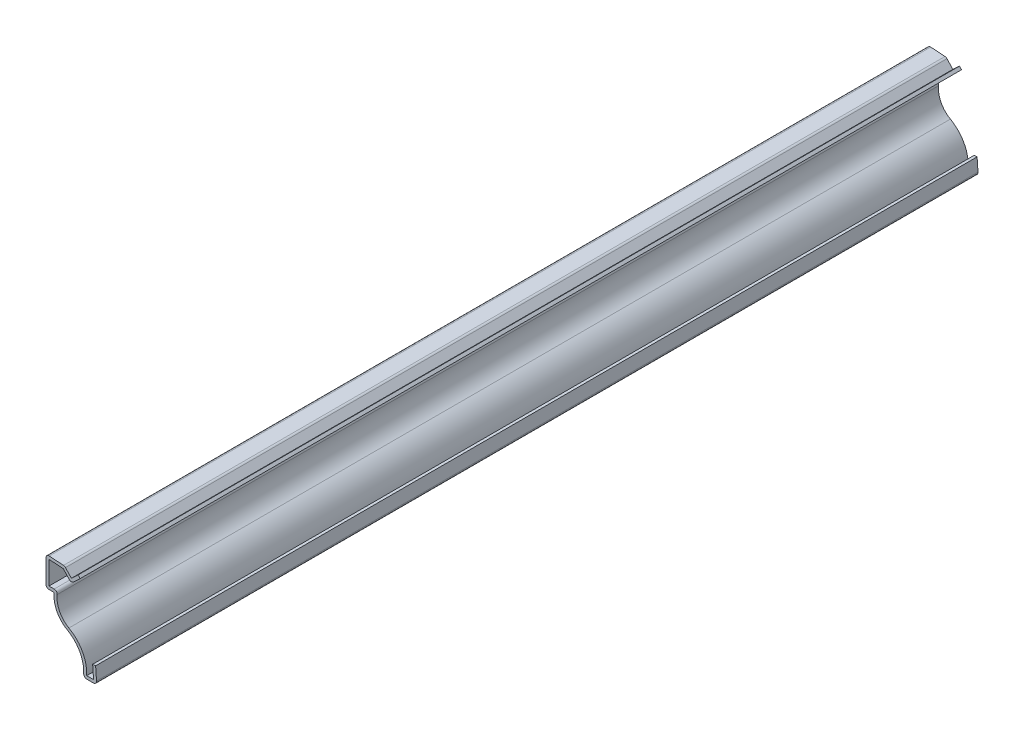
ISO-10303-21;
HEADER;
FILE_DESCRIPTION(('STEP AP214'),'2;1');
FILE_NAME('part.step','',(''),(''),'','','');
FILE_SCHEMA(('AUTOMOTIVE_DESIGN { 1 0 10303 214 1 1 1 1 }'));
ENDSEC;
DATA;
#1=APPLICATION_CONTEXT('core data for automotive mechanical design processes');
#2=APPLICATION_PROTOCOL_DEFINITION('international standard','automotive_design',2000,#1);
#3=PRODUCT_CONTEXT('',#1,'mechanical');
#4=PRODUCT('Part','Part','',(#3));
#5=PRODUCT_RELATED_PRODUCT_CATEGORY('part','',(#4));
#6=PRODUCT_DEFINITION_FORMATION('','',#4);
#7=PRODUCT_DEFINITION_CONTEXT('part definition',#1,'design');
#8=PRODUCT_DEFINITION('design','',#6,#7);
#9=PRODUCT_DEFINITION_SHAPE('','',#8);
#10=(LENGTH_UNIT() NAMED_UNIT(*) SI_UNIT(.MILLI.,.METRE.));
#11=(NAMED_UNIT(*) PLANE_ANGLE_UNIT() SI_UNIT($,.RADIAN.));
#12=(NAMED_UNIT(*) SI_UNIT($,.STERADIAN.) SOLID_ANGLE_UNIT());
#13=UNCERTAINTY_MEASURE_WITH_UNIT(LENGTH_MEASURE(1.E-05),#10,'distance_accuracy_value','');
#14=(GEOMETRIC_REPRESENTATION_CONTEXT(3) GLOBAL_UNCERTAINTY_ASSIGNED_CONTEXT((#13)) GLOBAL_UNIT_ASSIGNED_CONTEXT((#10,
#11,#12)) REPRESENTATION_CONTEXT('',''));
#15=CARTESIAN_POINT('',(0.,0.,0.));
#16=DIRECTION('',(0.,0.,1.));
#17=DIRECTION('',(1.,0.,0.));
#18=AXIS2_PLACEMENT_3D('',#15,#16,#17);
#19=CARTESIAN_POINT('',(-6.93432845790441,23.0270640514442,-261.9375));
#20=DIRECTION('',(0.681998360062503,-0.731353701619166,0.));
#21=DIRECTION('',(0.731353701619166,0.681998360062503,0.));
#22=AXIS2_PLACEMENT_3D('',#19,#20,#21);
#23=PLANE('',#22);
#24=DIRECTION('',(0.731353701619166,0.681998360062503,0.));
#25=VECTOR('',#24,1.);
#26=CARTESIAN_POINT('',(-6.93432845790441,23.0270640514442,0.));
#27=LINE('',#26,#25);
#28=CARTESIAN_POINT('',(-6.93432845790441,23.0270640514442,0.));
#29=VERTEX_POINT('',#28);
#30=CARTESIAN_POINT('',(-4.94995345790444,24.8775236754986,0.));
#31=VERTEX_POINT('',#30);
#32=EDGE_CURVE('E391',#29,#31,#27,.T.);
#33=ORIENTED_EDGE('',*,*,#32,.F.);
#34=DIRECTION('',(0.,0.,1.));
#35=VECTOR('',#34,1.);
#36=CARTESIAN_POINT('',(-6.93432845790441,23.0270640514442,-261.9375));
#37=LINE('',#36,#35);
#38=CARTESIAN_POINT('',(-6.93432845790441,23.0270640514442,-261.9375));
#39=VERTEX_POINT('',#38);
#40=EDGE_CURVE('E222',#29,#39,#37,.F.);
#41=ORIENTED_EDGE('',*,*,#40,.T.);
#42=DIRECTION('',(0.731353701619166,0.681998360062503,0.));
#43=VECTOR('',#42,1.);
#44=CARTESIAN_POINT('',(-6.93432845790441,23.0270640514442,-261.9375));
#45=LINE('',#44,#43);
#46=CARTESIAN_POINT('',(-4.94995345790444,24.8775236754986,-261.9375));
#47=VERTEX_POINT('',#46);
#48=EDGE_CURVE('E215',#39,#47,#45,.T.);
#49=ORIENTED_EDGE('',*,*,#48,.T.);
#50=DIRECTION('',(0.,0.,1.));
#51=VECTOR('',#50,1.);
#52=CARTESIAN_POINT('',(-4.94995345790444,24.8775236754986,-261.9375));
#53=LINE('',#52,#51);
#54=EDGE_CURVE('E219',#47,#31,#53,.T.);
#55=ORIENTED_EDGE('',*,*,#54,.T.);
#56=EDGE_LOOP('',(#33,#41,#49,#55));
#57=FACE_BOUND('',#56,.T.);
#58=ADVANCED_FACE('F35',(#57),#23,.T.);
#59=CARTESIAN_POINT('',(-10.1751734407394,25.1989226090433,-261.9375));
#60=DIRECTION('',(-0.731353701619166,-0.681998360062503,0.));
#61=DIRECTION('',(0.681998360062503,-0.731353701619166,0.));
#62=AXIS2_PLACEMENT_3D('',#59,#60,#61);
#63=PLANE('',#62);
#64=DIRECTION('',(0.681998360062503,-0.731353701619166,0.));
#65=VECTOR('',#64,1.);
#66=CARTESIAN_POINT('',(-10.1751734407394,25.1989226090433,-261.9375));
#67=LINE('',#66,#65);
#68=CARTESIAN_POINT('',(-9.93634688147888,24.9428124797694,-261.9375));
#69=VERTEX_POINT('',#68);
#70=CARTESIAN_POINT('',(-8.19079844073942,23.0709409500881,-261.9375));
#71=VERTEX_POINT('',#70);
#72=EDGE_CURVE('E240',#69,#71,#67,.T.);
#73=ORIENTED_EDGE('',*,*,#72,.T.);
#74=DIRECTION('',(0.,0.,1.));
#75=VECTOR('',#74,1.);
#76=CARTESIAN_POINT('',(-8.19079844073942,23.0709409500881,-261.9375));
#77=LINE('',#76,#75);
#78=CARTESIAN_POINT('',(-8.19079844073942,23.0709409500881,0.));
#79=VERTEX_POINT('',#78);
#80=EDGE_CURVE('E295',#71,#79,#77,.T.);
#81=ORIENTED_EDGE('',*,*,#80,.T.);
#82=DIRECTION('',(0.681998360062503,-0.731353701619166,0.));
#83=VECTOR('',#82,1.);
#84=CARTESIAN_POINT('',(-10.1751734407394,25.1989226090433,0.));
#85=LINE('',#84,#83);
#86=CARTESIAN_POINT('',(-9.93634688147888,24.9428124797694,0.));
#87=VERTEX_POINT('',#86);
#88=EDGE_CURVE('E225',#87,#79,#85,.T.);
#89=ORIENTED_EDGE('',*,*,#88,.F.);
#90=DIRECTION('',(0.,0.,1.));
#91=VECTOR('',#90,1.);
#92=CARTESIAN_POINT('',(-9.93634688147888,24.9428124797694,-261.9375));
#93=LINE('',#92,#91);
#94=EDGE_CURVE('E253',#69,#87,#93,.T.);
#95=ORIENTED_EDGE('',*,*,#94,.F.);
#96=EDGE_LOOP('',(#73,#81,#89,#95));
#97=FACE_BOUND('',#96,.T.);
#98=ADVANCED_FACE('F452',(#97),#63,.T.);
#99=CARTESIAN_POINT('',(-15.1432635051585,25.306915559319,-261.9375));
#100=DIRECTION('',(-0.0697564737441258,-0.997564050259824,0.));
#101=DIRECTION('',(0.997564050259824,-0.0697564737441258,0.));
#102=AXIS2_PLACEMENT_3D('',#99,#100,#101);
#103=PLANE('',#102);
#104=DIRECTION('',(0.997564050259824,-0.0697564737441258,0.));
#105=VECTOR('',#104,1.);
#106=CARTESIAN_POINT('',(-15.1432635051585,25.306915559319,0.));
#107=LINE('',#106,#105);
#108=CARTESIAN_POINT('',(-14.19225,25.2404142167881,0.));
#109=VERTEX_POINT('',#108);
#110=EDGE_CURVE('E355',#109,#87,#107,.T.);
#111=ORIENTED_EDGE('',*,*,#110,.F.);
#112=DIRECTION('',(0.,0.,1.));
#113=VECTOR('',#112,1.);
#114=CARTESIAN_POINT('',(-14.19225,25.2404142167881,-261.9375));
#115=LINE('',#114,#113);
#116=CARTESIAN_POINT('',(-14.19225,25.2404142167881,-261.9375));
#117=VERTEX_POINT('',#116);
#118=EDGE_CURVE('E361',#117,#109,#115,.T.);
#119=ORIENTED_EDGE('',*,*,#118,.F.);
#120=DIRECTION('',(0.997564050259824,-0.0697564737441258,0.));
#121=VECTOR('',#120,1.);
#122=CARTESIAN_POINT('',(-15.1432635051585,25.306915559319,-261.9375));
#123=LINE('',#122,#121);
#124=EDGE_CURVE('E245',#117,#69,#123,.T.);
#125=ORIENTED_EDGE('',*,*,#124,.T.);
#126=ORIENTED_EDGE('',*,*,#94,.T.);
#127=EDGE_LOOP('',(#111,#119,#125,#126));
#128=FACE_BOUND('',#127,.T.);
#129=ADVANCED_FACE('F457',(#128),#103,.T.);
#130=CARTESIAN_POINT('',(-14.19225,17.4625,-261.9375));
#131=DIRECTION('',(1.,0.,0.));
#132=DIRECTION('',(0.,0.,-1.));
#133=AXIS2_PLACEMENT_3D('',#130,#131,#132);
#134=PLANE('',#133);
#135=DIRECTION('',(0.,1.,0.));
#136=VECTOR('',#135,1.);
#137=CARTESIAN_POINT('',(-14.19225,17.4625,0.));
#138=LINE('',#137,#136);
#139=CARTESIAN_POINT('',(-14.19225,18.3515,0.));
#140=VERTEX_POINT('',#139);
#141=EDGE_CURVE('E352',#140,#109,#138,.T.);
#142=ORIENTED_EDGE('',*,*,#141,.F.);
#143=DIRECTION('',(0.,0.,1.));
#144=VECTOR('',#143,1.);
#145=CARTESIAN_POINT('',(-14.19225,18.3515,-261.9375));
#146=LINE('',#145,#144);
#147=CARTESIAN_POINT('',(-14.19225,18.3515,-261.9375));
#148=VERTEX_POINT('',#147);
#149=EDGE_CURVE('E363',#148,#140,#146,.T.);
#150=ORIENTED_EDGE('',*,*,#149,.F.);
#151=DIRECTION('',(0.,1.,0.));
#152=VECTOR('',#151,1.);
#153=CARTESIAN_POINT('',(-14.19225,17.4625,-261.9375));
#154=LINE('',#153,#152);
#155=EDGE_CURVE('E397',#148,#117,#154,.T.);
#156=ORIENTED_EDGE('',*,*,#155,.T.);
#157=ORIENTED_EDGE('',*,*,#118,.T.);
#158=EDGE_LOOP('',(#142,#150,#156,#157));
#159=FACE_BOUND('',#158,.T.);
#160=ADVANCED_FACE('F541',(#159),#134,.T.);
#161=CARTESIAN_POINT('',(-12.6494484067981,18.3515,-261.9375));
#162=DIRECTION('',(0.,1.,0.));
#163=DIRECTION('',(0.,0.,1.));
#164=AXIS2_PLACEMENT_3D('',#161,#162,#163);
#165=PLANE('',#164);
#166=DIRECTION('',(1.,0.,0.));
#167=VECTOR('',#166,1.);
#168=CARTESIAN_POINT('',(-12.6494484067981,18.3515,0.));
#169=LINE('',#168,#167);
#170=CARTESIAN_POINT('',(-12.6494484067981,18.3515,0.));
#171=VERTEX_POINT('',#170);
#172=EDGE_CURVE('E350',#171,#140,#169,.F.);
#173=ORIENTED_EDGE('',*,*,#172,.F.);
#174=DIRECTION('',(0.,0.,1.));
#175=VECTOR('',#174,1.);
#176=CARTESIAN_POINT('',(-12.6494484067981,18.3515,-261.9375));
#177=LINE('',#176,#175);
#178=CARTESIAN_POINT('',(-12.6494484067981,18.3515,-261.9375));
#179=VERTEX_POINT('',#178);
#180=EDGE_CURVE('E302',#171,#179,#177,.F.);
#181=ORIENTED_EDGE('',*,*,#180,.T.);
#182=DIRECTION('',(1.,0.,0.));
#183=VECTOR('',#182,1.);
#184=CARTESIAN_POINT('',(-12.6494484067981,18.3515,-261.9375));
#185=LINE('',#184,#183);
#186=EDGE_CURVE('E400',#179,#148,#185,.F.);
#187=ORIENTED_EDGE('',*,*,#186,.T.);
#188=ORIENTED_EDGE('',*,*,#149,.T.);
#189=EDGE_LOOP('',(#173,#181,#187,#188));
#190=FACE_BOUND('',#189,.T.);
#191=ADVANCED_FACE('F537',(#190),#165,.T.);
#192=CARTESIAN_POINT('',(-4.85775,16.5735,-261.9375));
#193=DIRECTION('',(0.,0.,1.));
#194=DIRECTION('',(1.,0.,0.));
#195=AXIS2_PLACEMENT_3D('',#192,#193,#194);
#196=CYLINDRICAL_SURFACE('',#195,6.95325);
#197=CARTESIAN_POINT('',(-4.85775,16.5735,-261.9375));
#198=DIRECTION('',(0.,0.,1.));
#199=DIRECTION('',(1.,0.,0.));
#200=AXIS2_PLACEMENT_3D('',#197,#198,#199);
#201=CIRCLE('',#200,6.95325);
#202=CARTESIAN_POINT('',(-8.27128367162748,10.5158211181868,-261.9375));
#203=VERTEX_POINT('',#202);
#204=CARTESIAN_POINT('',(-11.7661789517765,17.3617226720648,-261.9375));
#205=VERTEX_POINT('',#204);
#206=EDGE_CURVE('E402',#203,#205,#201,.F.);
#207=ORIENTED_EDGE('',*,*,#206,.T.);
#208=DIRECTION('',(0.,0.,1.));
#209=VECTOR('',#208,1.);
#210=CARTESIAN_POINT('',(-11.7661789517765,17.3617226720648,-261.9375));
#211=LINE('',#210,#209);
#212=CARTESIAN_POINT('',(-11.7661789517765,17.3617226720648,0.));
#213=VERTEX_POINT('',#212);
#214=EDGE_CURVE('E299',#205,#213,#211,.T.);
#215=ORIENTED_EDGE('',*,*,#214,.T.);
#216=CARTESIAN_POINT('',(-4.85775,16.5735,0.));
#217=DIRECTION('',(0.,0.,1.));
#218=DIRECTION('',(1.,0.,0.));
#219=AXIS2_PLACEMENT_3D('',#216,#217,#218);
#220=CIRCLE('',#219,6.95325);
#221=CARTESIAN_POINT('',(-8.27128367162748,10.5158211181868,0.));
#222=VERTEX_POINT('',#221);
#223=EDGE_CURVE('E347',#222,#213,#220,.F.);
#224=ORIENTED_EDGE('',*,*,#223,.F.);
#225=DIRECTION('',(0.,0.,1.));
#226=VECTOR('',#225,1.);
#227=CARTESIAN_POINT('',(-8.27128367162748,10.5158211181868,-261.9375));
#228=LINE('',#227,#226);
#229=EDGE_CURVE('E366',#203,#222,#228,.T.);
#230=ORIENTED_EDGE('',*,*,#229,.F.);
#231=EDGE_LOOP('',(#207,#215,#224,#230));
#232=FACE_BOUND('',#231,.T.);
#233=ADVANCED_FACE('F489',(#232),#196,.F.);
#234=CARTESIAN_POINT('',(-13.3837907231974,1.44313311254879,-261.9375));
#235=DIRECTION('',(0.,0.,1.));
#236=DIRECTION('',(1.,0.,0.));
#237=AXIS2_PLACEMENT_3D('',#234,#235,#236);
#238=CYLINDRICAL_SURFACE('',#237,10.414);
#239=CARTESIAN_POINT('',(-13.3837907231974,1.44313311254879,0.));
#240=DIRECTION('',(0.,0.,1.));
#241=DIRECTION('',(1.,0.,0.));
#242=AXIS2_PLACEMENT_3D('',#239,#240,#241);
#243=CIRCLE('',#242,10.414);
#244=CARTESIAN_POINT('',(-2.9845439959783,0.889,0.));
#245=VERTEX_POINT('',#244);
#246=EDGE_CURVE('E344',#245,#222,#243,.T.);
#247=ORIENTED_EDGE('',*,*,#246,.F.);
#248=DIRECTION('',(0.,0.,1.));
#249=VECTOR('',#248,1.);
#250=CARTESIAN_POINT('',(-2.9845439959783,0.889,-261.9375));
#251=LINE('',#250,#249);
#252=CARTESIAN_POINT('',(-2.9845439959783,0.889,-261.9375));
#253=VERTEX_POINT('',#252);
#254=EDGE_CURVE('E368',#253,#245,#251,.T.);
#255=ORIENTED_EDGE('',*,*,#254,.F.);
#256=CARTESIAN_POINT('',(-13.3837907231974,1.44313311254879,-261.9375));
#257=DIRECTION('',(0.,0.,1.));
#258=DIRECTION('',(1.,0.,0.));
#259=AXIS2_PLACEMENT_3D('',#256,#257,#258);
#260=CIRCLE('',#259,10.414);
#261=EDGE_CURVE('E405',#253,#203,#260,.T.);
#262=ORIENTED_EDGE('',*,*,#261,.T.);
#263=ORIENTED_EDGE('',*,*,#229,.T.);
#264=EDGE_LOOP('',(#247,#255,#262,#263));
#265=FACE_BOUND('',#264,.T.);
#266=ADVANCED_FACE('F493',(#265),#238,.T.);
#267=CARTESIAN_POINT('',(0.,0.889,-261.9375));
#268=DIRECTION('',(0.,1.,0.));
#269=DIRECTION('',(-1.,0.,0.));
#270=AXIS2_PLACEMENT_3D('',#267,#268,#269);
#271=PLANE('',#270);
#272=DIRECTION('',(-1.,0.,0.));
#273=VECTOR('',#272,1.);
#274=CARTESIAN_POINT('',(0.,0.889,0.));
#275=LINE('',#274,#273);
#276=CARTESIAN_POINT('',(-0.953335783211936,0.889,0.));
#277=VERTEX_POINT('',#276);
#278=EDGE_CURVE('E341',#277,#245,#275,.T.);
#279=ORIENTED_EDGE('',*,*,#278,.F.);
#280=DIRECTION('',(0.,0.,1.));
#281=VECTOR('',#280,1.);
#282=CARTESIAN_POINT('',(-0.953335783211936,0.889,-261.9375));
#283=LINE('',#282,#281);
#284=CARTESIAN_POINT('',(-0.953335783211936,0.889,-261.9375));
#285=VERTEX_POINT('',#284);
#286=EDGE_CURVE('E370',#285,#277,#283,.T.);
#287=ORIENTED_EDGE('',*,*,#286,.F.);
#288=DIRECTION('',(-1.,0.,0.));
#289=VECTOR('',#288,1.);
#290=CARTESIAN_POINT('',(0.,0.889,-261.9375));
#291=LINE('',#290,#289);
#292=EDGE_CURVE('E408',#285,#253,#291,.T.);
#293=ORIENTED_EDGE('',*,*,#292,.T.);
#294=ORIENTED_EDGE('',*,*,#254,.T.);
#295=EDGE_LOOP('',(#279,#287,#293,#294));
#296=FACE_BOUND('',#295,.T.);
#297=ADVANCED_FACE('F498',(#296),#271,.T.);
#298=CARTESIAN_POINT('',(-1.21986088256192,4.70048649484148,-261.9375));
#299=DIRECTION('',(-0.997564050259825,-0.0697564737441184,0.));
#300=DIRECTION('',(0.0697564737441184,-0.997564050259825,0.));
#301=AXIS2_PLACEMENT_3D('',#298,#299,#300);
#302=PLANE('',#301);
#303=DIRECTION('',(0.0697564737441184,-0.997564050259825,0.));
#304=VECTOR('',#303,1.);
#305=CARTESIAN_POINT('',(-1.21986088256192,4.70048649484148,0.));
#306=LINE('',#305,#304);
#307=CARTESIAN_POINT('',(-1.21986088256192,4.70048649484148,0.));
#308=VERTEX_POINT('',#307);
#309=EDGE_CURVE('E338',#308,#277,#306,.T.);
#310=ORIENTED_EDGE('',*,*,#309,.F.);
#311=DIRECTION('',(0.,0.,1.));
#312=VECTOR('',#311,1.);
#313=CARTESIAN_POINT('',(-1.21986088256192,4.70048649484148,-261.9375));
#314=LINE('',#313,#312);
#315=CARTESIAN_POINT('',(-1.21986088256192,4.70048649484148,-261.9375));
#316=VERTEX_POINT('',#315);
#317=EDGE_CURVE('E372',#316,#308,#314,.T.);
#318=ORIENTED_EDGE('',*,*,#317,.F.);
#319=DIRECTION('',(0.0697564737441184,-0.997564050259825,0.));
#320=VECTOR('',#319,1.);
#321=CARTESIAN_POINT('',(-1.21986088256192,4.70048649484148,-261.9375));
#322=LINE('',#321,#320);
#323=EDGE_CURVE('E411',#316,#285,#322,.T.);
#324=ORIENTED_EDGE('',*,*,#323,.T.);
#325=ORIENTED_EDGE('',*,*,#286,.T.);
#326=EDGE_LOOP('',(#310,#318,#324,#325));
#327=FACE_BOUND('',#326,.T.);
#328=ADVANCED_FACE('F501',(#327),#302,.T.);
#329=CARTESIAN_POINT('',(-1.21986088256192,4.70048649484148,-261.9375));
#330=DIRECTION('',(0.0697564737441186,-0.997564050259825,0.));
#331=DIRECTION('',(0.997564050259825,0.0697564737441186,0.));
#332=AXIS2_PLACEMENT_3D('',#329,#330,#331);
#333=PLANE('',#332);
#334=DIRECTION('',(0.997564050259825,0.0697564737441186,0.));
#335=VECTOR('',#334,1.);
#336=CARTESIAN_POINT('',(-1.21986088256192,4.70048649484148,0.));
#337=LINE('',#336,#335);
#338=CARTESIAN_POINT('',(-0.333026441880935,4.7625,0.));
#339=VERTEX_POINT('',#338);
#340=EDGE_CURVE('E336',#308,#339,#337,.T.);
#341=ORIENTED_EDGE('',*,*,#340,.T.);
#342=DIRECTION('',(0.,0.,1.));
#343=VECTOR('',#342,1.);
#344=CARTESIAN_POINT('',(-0.333026441880935,4.7625,-261.9375));
#345=LINE('',#344,#343);
#346=CARTESIAN_POINT('',(-0.333026441880935,4.7625,-261.9375));
#347=VERTEX_POINT('',#346);
#348=EDGE_CURVE('E374',#347,#339,#345,.T.);
#349=ORIENTED_EDGE('',*,*,#348,.F.);
#350=DIRECTION('',(0.997564050259825,0.0697564737441186,0.));
#351=VECTOR('',#350,1.);
#352=CARTESIAN_POINT('',(-1.21986088256192,4.70048649484148,-261.9375));
#353=LINE('',#352,#351);
#354=EDGE_CURVE('E414',#316,#347,#353,.T.);
#355=ORIENTED_EDGE('',*,*,#354,.F.);
#356=ORIENTED_EDGE('',*,*,#317,.T.);
#357=EDGE_LOOP('',(#341,#349,#355,#356));
#358=FACE_BOUND('',#357,.T.);
#359=ADVANCED_FACE('F507',(#358),#333,.F.);
#360=CARTESIAN_POINT('',(-0.333026441880935,4.7625,-261.9375));
#361=DIRECTION('',(-0.997564050259825,-0.0697564737441184,0.));
#362=DIRECTION('',(0.0697564737441184,-0.997564050259825,0.));
#363=AXIS2_PLACEMENT_3D('',#360,#361,#362);
#364=PLANE('',#363);
#365=DIRECTION('',(0.0697564737441184,-0.997564050259825,0.));
#366=VECTOR('',#365,1.);
#367=CARTESIAN_POINT('',(-0.333026441880935,4.7625,0.));
#368=LINE('',#367,#366);
#369=CARTESIAN_POINT('',(-0.066501342530952,0.951013505158522,0.));
#370=VERTEX_POINT('',#369);
#371=EDGE_CURVE('E333',#339,#370,#368,.T.);
#372=ORIENTED_EDGE('',*,*,#371,.T.);
#373=DIRECTION('',(0.,0.,1.));
#374=VECTOR('',#373,1.);
#375=CARTESIAN_POINT('',(-0.066501342530952,0.951013505158521,-261.9375));
#376=LINE('',#375,#374);
#377=CARTESIAN_POINT('',(-0.066501342530952,0.951013505158522,-261.9375));
#378=VERTEX_POINT('',#377);
#379=EDGE_CURVE('E290',#370,#378,#376,.F.);
#380=ORIENTED_EDGE('',*,*,#379,.T.);
#381=DIRECTION('',(0.0697564737441184,-0.997564050259825,0.));
#382=VECTOR('',#381,1.);
#383=CARTESIAN_POINT('',(-0.333026441880935,4.7625,-261.9375));
#384=LINE('',#383,#382);
#385=EDGE_CURVE('E416',#347,#378,#384,.T.);
#386=ORIENTED_EDGE('',*,*,#385,.F.);
#387=ORIENTED_EDGE('',*,*,#348,.T.);
#388=EDGE_LOOP('',(#372,#380,#386,#387));
#389=FACE_BOUND('',#388,.T.);
#390=ADVANCED_FACE('F511',(#389),#364,.F.);
#391=CARTESIAN_POINT('',(0.,0.,-261.9375));
#392=DIRECTION('',(0.,1.,0.));
#393=DIRECTION('',(-1.,0.,0.));
#394=AXIS2_PLACEMENT_3D('',#391,#392,#393);
#395=PLANE('',#394);
#396=DIRECTION('',(-1.,0.,0.));
#397=VECTOR('',#396,1.);
#398=CARTESIAN_POINT('',(0.,0.,-261.9375));
#399=LINE('',#398,#397);
#400=CARTESIAN_POINT('',(-0.953335783211936,0.,-261.9375));
#401=VERTEX_POINT('',#400);
#402=CARTESIAN_POINT('',(-2.9845439959783,0.,-261.9375));
#403=VERTEX_POINT('',#402);
#404=EDGE_CURVE('E419',#401,#403,#399,.T.);
#405=ORIENTED_EDGE('',*,*,#404,.F.);
#406=DIRECTION('',(0.,0.,1.));
#407=VECTOR('',#406,1.);
#408=CARTESIAN_POINT('',(-0.953335783211936,0.,-261.9375));
#409=LINE('',#408,#407);
#410=CARTESIAN_POINT('',(-0.953335783211936,0.,0.));
#411=VERTEX_POINT('',#410);
#412=EDGE_CURVE('E287',#401,#411,#409,.T.);
#413=ORIENTED_EDGE('',*,*,#412,.T.);
#414=DIRECTION('',(-1.,0.,0.));
#415=VECTOR('',#414,1.);
#416=CARTESIAN_POINT('',(0.,0.,0.));
#417=LINE('',#416,#415);
#418=CARTESIAN_POINT('',(-2.9845439959783,0.,0.));
#419=VERTEX_POINT('',#418);
#420=EDGE_CURVE('E330',#411,#419,#417,.T.);
#421=ORIENTED_EDGE('',*,*,#420,.T.);
#422=DIRECTION('',(0.,0.,1.));
#423=VECTOR('',#422,1.);
#424=CARTESIAN_POINT('',(-2.9845439959783,0.,-261.9375));
#425=LINE('',#424,#423);
#426=EDGE_CURVE('E285',#419,#403,#425,.F.);
#427=ORIENTED_EDGE('',*,*,#426,.T.);
#428=EDGE_LOOP('',(#405,#413,#421,#427));
#429=FACE_BOUND('',#428,.T.);
#430=ADVANCED_FACE('F517',(#429),#395,.F.);
#431=CARTESIAN_POINT('',(-13.3837907231974,1.44313311254879,-261.9375));
#432=DIRECTION('',(0.,0.,1.));
#433=DIRECTION('',(1.,0.,0.));
#434=AXIS2_PLACEMENT_3D('',#431,#432,#433);
#435=CYLINDRICAL_SURFACE('',#434,9.525);
#436=CARTESIAN_POINT('',(-13.3837907231974,1.44313311254879,-261.9375));
#437=DIRECTION('',(0.,0.,1.));
#438=DIRECTION('',(1.,0.,0.));
#439=AXIS2_PLACEMENT_3D('',#436,#437,#438);
#440=CIRCLE('',#439,9.525);
#441=CARTESIAN_POINT('',(-3.8722845702531,0.936304046193189,-261.9375));
#442=VERTEX_POINT('',#441);
#443=CARTESIAN_POINT('',(-8.70771720042003,9.74132336160795,-261.9375));
#444=VERTEX_POINT('',#443);
#445=EDGE_CURVE('E422',#442,#444,#440,.T.);
#446=ORIENTED_EDGE('',*,*,#445,.F.);
#447=DIRECTION('',(0.,0.,1.));
#448=VECTOR('',#447,1.);
#449=CARTESIAN_POINT('',(-3.8722845702531,0.936304046193189,-261.9375));
#450=LINE('',#449,#448);
#451=CARTESIAN_POINT('',(-3.8722845702531,0.936304046193189,0.));
#452=VERTEX_POINT('',#451);
#453=EDGE_CURVE('E292',#442,#452,#450,.T.);
#454=ORIENTED_EDGE('',*,*,#453,.T.);
#455=CARTESIAN_POINT('',(-13.3837907231974,1.44313311254879,0.));
#456=DIRECTION('',(0.,0.,1.));
#457=DIRECTION('',(1.,0.,0.));
#458=AXIS2_PLACEMENT_3D('',#455,#456,#457);
#459=CIRCLE('',#458,9.525);
#460=CARTESIAN_POINT('',(-8.70771720042003,9.74132336160795,0.));
#461=VERTEX_POINT('',#460);
#462=EDGE_CURVE('E328',#452,#461,#459,.T.);
#463=ORIENTED_EDGE('',*,*,#462,.T.);
#464=DIRECTION('',(0.,0.,1.));
#465=VECTOR('',#464,1.);
#466=CARTESIAN_POINT('',(-8.70771720042003,9.74132336160795,-261.9375));
#467=LINE('',#466,#465);
#468=EDGE_CURVE('E377',#444,#461,#467,.T.);
#469=ORIENTED_EDGE('',*,*,#468,.F.);
#470=EDGE_LOOP('',(#446,#454,#463,#469));
#471=FACE_BOUND('',#470,.T.);
#472=ADVANCED_FACE('F524',(#471),#435,.F.);
#473=CARTESIAN_POINT('',(-4.85775,16.5735,-261.9375));
#474=DIRECTION('',(0.,0.,1.));
#475=DIRECTION('',(1.,0.,0.));
#476=AXIS2_PLACEMENT_3D('',#473,#474,#475);
#477=CYLINDRICAL_SURFACE('',#476,7.84225);
#478=CARTESIAN_POINT('',(-4.85775,16.5735,0.));
#479=DIRECTION('',(0.,0.,-1.));
#480=DIRECTION('',(-1.,0.,0.));
#481=AXIS2_PLACEMENT_3D('',#478,#479,#480);
#482=CIRCLE('',#481,7.84225);
#483=CARTESIAN_POINT('',(-12.6494484067981,17.4625,0.));
#484=VERTEX_POINT('',#483);
#485=EDGE_CURVE('E320',#461,#484,#482,.T.);
#486=ORIENTED_EDGE('',*,*,#485,.T.);
#487=DIRECTION('',(0.,0.,1.));
#488=VECTOR('',#487,1.);
#489=CARTESIAN_POINT('',(-12.6494484067981,17.4625,-261.9375));
#490=LINE('',#489,#488);
#491=CARTESIAN_POINT('',(-12.6494484067981,17.4625,-261.9375));
#492=VERTEX_POINT('',#491);
#493=EDGE_CURVE('E380',#492,#484,#490,.T.);
#494=ORIENTED_EDGE('',*,*,#493,.F.);
#495=CARTESIAN_POINT('',(-4.85775,16.5735,-261.9375));
#496=DIRECTION('',(0.,0.,-1.));
#497=DIRECTION('',(-1.,0.,0.));
#498=AXIS2_PLACEMENT_3D('',#495,#496,#497);
#499=CIRCLE('',#498,7.84225);
#500=EDGE_CURVE('E424',#444,#492,#499,.T.);
#501=ORIENTED_EDGE('',*,*,#500,.F.);
#502=ORIENTED_EDGE('',*,*,#468,.T.);
#503=EDGE_LOOP('',(#486,#494,#501,#502));
#504=FACE_BOUND('',#503,.T.);
#505=ADVANCED_FACE('F530',(#504),#477,.T.);
#506=CARTESIAN_POINT('',(-12.6494484067981,17.4625,-261.9375));
#507=DIRECTION('',(0.,1.,0.));
#508=DIRECTION('',(0.,0.,1.));
#509=AXIS2_PLACEMENT_3D('',#506,#507,#508);
#510=PLANE('',#509);
#511=DIRECTION('',(-1.,0.,0.));
#512=VECTOR('',#511,1.);
#513=CARTESIAN_POINT('',(-12.6494484067981,17.4625,0.));
#514=LINE('',#513,#512);
#515=CARTESIAN_POINT('',(-14.19225,17.4625,0.));
#516=VERTEX_POINT('',#515);
#517=EDGE_CURVE('E317',#484,#516,#514,.T.);
#518=ORIENTED_EDGE('',*,*,#517,.T.);
#519=DIRECTION('',(0.,0.,1.));
#520=VECTOR('',#519,1.);
#521=CARTESIAN_POINT('',(-14.19225,17.4625,-261.9375));
#522=LINE('',#521,#520);
#523=CARTESIAN_POINT('',(-14.19225,17.4625,-261.9375));
#524=VERTEX_POINT('',#523);
#525=EDGE_CURVE('E11',#516,#524,#522,.F.);
#526=ORIENTED_EDGE('',*,*,#525,.T.);
#527=DIRECTION('',(-1.,0.,0.));
#528=VECTOR('',#527,1.);
#529=CARTESIAN_POINT('',(-12.6494484067981,17.4625,-261.9375));
#530=LINE('',#529,#528);
#531=EDGE_CURVE('E426',#492,#524,#530,.T.);
#532=ORIENTED_EDGE('',*,*,#531,.F.);
#533=ORIENTED_EDGE('',*,*,#493,.T.);
#534=EDGE_LOOP('',(#518,#526,#532,#533));
#535=FACE_BOUND('',#534,.T.);
#536=ADVANCED_FACE('F534',(#535),#510,.F.);
#537=CARTESIAN_POINT('',(-15.08125,17.4625,-261.9375));
#538=DIRECTION('',(1.,0.,0.));
#539=DIRECTION('',(0.,0.,-1.));
#540=AXIS2_PLACEMENT_3D('',#537,#538,#539);
#541=PLANE('',#540);
#542=DIRECTION('',(0.,1.,0.));
#543=VECTOR('',#542,1.);
#544=CARTESIAN_POINT('',(-15.08125,17.4625,-261.9375));
#545=LINE('',#544,#543);
#546=CARTESIAN_POINT('',(-15.08125,18.3515,-261.9375));
#547=VERTEX_POINT('',#546);
#548=CARTESIAN_POINT('',(-15.08125,25.2404142167881,-261.9375));
#549=VERTEX_POINT('',#548);
#550=EDGE_CURVE('E309',#547,#549,#545,.T.);
#551=ORIENTED_EDGE('',*,*,#550,.F.);
#552=DIRECTION('',(0.,0.,1.));
#553=VECTOR('',#552,1.);
#554=CARTESIAN_POINT('',(-15.08125,18.3515,-261.9375));
#555=LINE('',#554,#553);
#556=CARTESIAN_POINT('',(-15.08125,18.3515,0.));
#557=VERTEX_POINT('',#556);
#558=EDGE_CURVE('E43',#547,#557,#555,.T.);
#559=ORIENTED_EDGE('',*,*,#558,.T.);
#560=DIRECTION('',(0.,1.,0.));
#561=VECTOR('',#560,1.);
#562=CARTESIAN_POINT('',(-15.08125,17.4625,0.));
#563=LINE('',#562,#561);
#564=CARTESIAN_POINT('',(-15.08125,25.2404142167881,0.));
#565=VERTEX_POINT('',#564);
#566=EDGE_CURVE('E308',#557,#565,#563,.T.);
#567=ORIENTED_EDGE('',*,*,#566,.T.);
#568=DIRECTION('',(0.,0.,1.));
#569=VECTOR('',#568,1.);
#570=CARTESIAN_POINT('',(-15.08125,25.2404142167881,-261.9375));
#571=LINE('',#570,#569);
#572=EDGE_CURVE('E50',#565,#549,#571,.F.);
#573=ORIENTED_EDGE('',*,*,#572,.T.);
#574=EDGE_LOOP('',(#551,#559,#567,#573));
#575=FACE_BOUND('',#574,.T.);
#576=ADVANCED_FACE('F307',(#575),#541,.F.);
#577=CARTESIAN_POINT('',(-15.08125,26.19375,-261.9375));
#578=DIRECTION('',(-0.0697564737441258,-0.997564050259824,0.));
#579=DIRECTION('',(0.997564050259824,-0.0697564737441258,0.));
#580=AXIS2_PLACEMENT_3D('',#577,#578,#579);
#581=PLANE('',#580);
#582=DIRECTION('',(0.997564050259824,-0.0697564737441258,0.));
#583=VECTOR('',#582,1.);
#584=CARTESIAN_POINT('',(-15.08125,26.19375,0.));
#585=LINE('',#584,#583);
#586=CARTESIAN_POINT('',(-14.1302364948415,26.127248657469,0.));
#587=VERTEX_POINT('',#586);
#588=CARTESIAN_POINT('',(-9.87433337632036,25.8296469204504,0.));
#589=VERTEX_POINT('',#588);
#590=EDGE_CURVE('E318',#587,#589,#585,.T.);
#591=ORIENTED_EDGE('',*,*,#590,.T.);
#592=DIRECTION('',(0.,0.,1.));
#593=VECTOR('',#592,1.);
#594=CARTESIAN_POINT('',(-9.87433337632036,25.8296469204504,-261.9375));
#595=LINE('',#594,#593);
#596=CARTESIAN_POINT('',(-9.87433337632036,25.8296469204504,-261.9375));
#597=VERTEX_POINT('',#596);
#598=EDGE_CURVE('E270',#589,#597,#595,.F.);
#599=ORIENTED_EDGE('',*,*,#598,.T.);
#600=DIRECTION('',(0.997564050259824,-0.0697564737441258,0.));
#601=VECTOR('',#600,1.);
#602=CARTESIAN_POINT('',(-15.08125,26.19375,-261.9375));
#603=LINE('',#602,#601);
#604=CARTESIAN_POINT('',(-14.1302364948415,26.127248657469,-261.9375));
#605=VERTEX_POINT('',#604);
#606=EDGE_CURVE('E429',#605,#597,#603,.T.);
#607=ORIENTED_EDGE('',*,*,#606,.F.);
#608=DIRECTION('',(0.,0.,1.));
#609=VECTOR('',#608,1.);
#610=CARTESIAN_POINT('',(-14.1302364948415,26.127248657469,-261.9375));
#611=LINE('',#610,#609);
#612=EDGE_CURVE('E267',#605,#587,#611,.T.);
#613=ORIENTED_EDGE('',*,*,#612,.T.);
#614=EDGE_LOOP('',(#591,#599,#607,#613));
#615=FACE_BOUND('',#614,.T.);
#616=ADVANCED_FACE('F440',(#615),#581,.F.);
#617=CARTESIAN_POINT('',(-9.525,25.8052191511389,-261.9375));
#618=DIRECTION('',(-0.731353701619166,-0.681998360062503,0.));
#619=DIRECTION('',(0.681998360062503,-0.731353701619166,0.));
#620=AXIS2_PLACEMENT_3D('',#617,#618,#619);
#621=PLANE('',#620);
#622=DIRECTION('',(0.681998360062503,-0.731353701619166,0.));
#623=VECTOR('',#622,1.);
#624=CARTESIAN_POINT('',(-9.525,25.8052191511389,-261.9375));
#625=LINE('',#624,#623);
#626=CARTESIAN_POINT('',(-9.28617344073945,25.549109021865,-261.9375));
#627=VERTEX_POINT('',#626);
#628=CARTESIAN_POINT('',(-7.54062499999998,23.6772374921836,-261.9375));
#629=VERTEX_POINT('',#628);
#630=EDGE_CURVE('E431',#627,#629,#625,.T.);
#631=ORIENTED_EDGE('',*,*,#630,.F.);
#632=DIRECTION('',(0.,0.,1.));
#633=VECTOR('',#632,1.);
#634=CARTESIAN_POINT('',(-9.28617344073945,25.549109021865,-261.9375));
#635=LINE('',#634,#633);
#636=CARTESIAN_POINT('',(-9.28617344073945,25.549109021865,0.));
#637=VERTEX_POINT('',#636);
#638=EDGE_CURVE('E249',#627,#637,#635,.T.);
#639=ORIENTED_EDGE('',*,*,#638,.T.);
#640=DIRECTION('',(0.681998360062503,-0.731353701619166,0.));
#641=VECTOR('',#640,1.);
#642=CARTESIAN_POINT('',(-9.525,25.8052191511389,0.));
#643=LINE('',#642,#641);
#644=CARTESIAN_POINT('',(-7.54062499999998,23.6772374921836,0.));
#645=VERTEX_POINT('',#644);
#646=EDGE_CURVE('E323',#637,#645,#643,.T.);
#647=ORIENTED_EDGE('',*,*,#646,.T.);
#648=DIRECTION('',(0.,0.,1.));
#649=VECTOR('',#648,1.);
#650=CARTESIAN_POINT('',(-7.54062499999998,23.6772374921836,-261.9375));
#651=LINE('',#650,#649);
#652=EDGE_CURVE('E242',#629,#645,#651,.T.);
#653=ORIENTED_EDGE('',*,*,#652,.F.);
#654=EDGE_LOOP('',(#631,#639,#647,#653));
#655=FACE_BOUND('',#654,.T.);
#656=ADVANCED_FACE('F435',(#655),#621,.F.);
#657=CARTESIAN_POINT('',(-7.54062499999998,23.6772374921836,-261.9375));
#658=DIRECTION('',(0.681998360062503,-0.731353701619166,0.));
#659=DIRECTION('',(0.731353701619166,0.681998360062503,0.));
#660=AXIS2_PLACEMENT_3D('',#657,#658,#659);
#661=PLANE('',#660);
#662=DIRECTION('',(0.731353701619166,0.681998360062503,0.));
#663=VECTOR('',#662,1.);
#664=CARTESIAN_POINT('',(-7.54062499999998,23.6772374921836,0.));
#665=LINE('',#664,#663);
#666=CARTESIAN_POINT('',(-5.55625,25.5276971162381,0.));
#667=VERTEX_POINT('',#666);
#668=EDGE_CURVE('E387',#645,#667,#665,.T.);
#669=ORIENTED_EDGE('',*,*,#668,.T.);
#670=DIRECTION('',(0.,0.,1.));
#671=VECTOR('',#670,1.);
#672=CARTESIAN_POINT('',(-5.55625,25.5276971162381,-261.9375));
#673=LINE('',#672,#671);
#674=CARTESIAN_POINT('',(-5.55625,25.5276971162381,-261.9375));
#675=VERTEX_POINT('',#674);
#676=EDGE_CURVE('E239',#675,#667,#673,.T.);
#677=ORIENTED_EDGE('',*,*,#676,.F.);
#678=DIRECTION('',(0.731353701619166,0.681998360062503,0.));
#679=VECTOR('',#678,1.);
#680=CARTESIAN_POINT('',(-7.54062499999998,23.6772374921836,-261.9375));
#681=LINE('',#680,#679);
#682=EDGE_CURVE('E231',#629,#675,#681,.T.);
#683=ORIENTED_EDGE('',*,*,#682,.F.);
#684=ORIENTED_EDGE('',*,*,#652,.T.);
#685=EDGE_LOOP('',(#669,#677,#683,#684));
#686=FACE_BOUND('',#685,.T.);
#687=ADVANCED_FACE('F386',(#686),#661,.F.);
#688=CARTESIAN_POINT('',(-5.55625,25.5276971162381,-261.9375));
#689=DIRECTION('',(-0.731353701619166,-0.681998360062504,0.));
#690=DIRECTION('',(0.681998360062504,-0.731353701619166,0.));
#691=AXIS2_PLACEMENT_3D('',#688,#689,#690);
#692=PLANE('',#691);
#693=DIRECTION('',(0.681998360062503,-0.731353701619166,0.));
#694=VECTOR('',#693,1.);
#695=CARTESIAN_POINT('',(-5.55625,25.5276971162381,0.));
#696=LINE('',#695,#694);
#697=EDGE_CURVE('E238',#667,#31,#696,.T.);
#698=ORIENTED_EDGE('',*,*,#697,.T.);
#699=ORIENTED_EDGE('',*,*,#54,.F.);
#700=DIRECTION('',(0.681998360062503,-0.731353701619166,0.));
#701=VECTOR('',#700,1.);
#702=CARTESIAN_POINT('',(-5.55625,25.5276971162381,-261.9375));
#703=LINE('',#702,#701);
#704=EDGE_CURVE('E224',#675,#47,#703,.T.);
#705=ORIENTED_EDGE('',*,*,#704,.F.);
#706=ORIENTED_EDGE('',*,*,#676,.T.);
#707=EDGE_LOOP('',(#698,#699,#705,#706));
#708=FACE_BOUND('',#707,.T.);
#709=ADVANCED_FACE('F236',(#708),#692,.F.);
#710=CARTESIAN_POINT('',(-4.85775,16.5735,-261.9375));
#711=DIRECTION('',(0.,0.,-1.));
#712=DIRECTION('',(-1.,0.,0.));
#713=AXIS2_PLACEMENT_3D('',#710,#711,#712);
#714=PLANE('',#713);
#715=ORIENTED_EDGE('',*,*,#606,.T.);
#716=CARTESIAN_POINT('',(-9.93634688147888,24.9428124797694,-261.9375));
#717=DIRECTION('',(0.,0.,-1.));
#718=DIRECTION('',(-1.,0.,0.));
#719=AXIS2_PLACEMENT_3D('',#716,#717,#718);
#720=CIRCLE('',#719,0.889);
#721=EDGE_CURVE('E283',#597,#627,#720,.T.);
#722=ORIENTED_EDGE('',*,*,#721,.T.);
#723=ORIENTED_EDGE('',*,*,#630,.T.);
#724=ORIENTED_EDGE('',*,*,#682,.T.);
#725=ORIENTED_EDGE('',*,*,#704,.T.);
#726=ORIENTED_EDGE('',*,*,#48,.F.);
#727=CARTESIAN_POINT('',(-7.54062499999998,23.6772374921836,-261.9375));
#728=DIRECTION('',(0.,0.,-1.));
#729=DIRECTION('',(-1.,0.,0.));
#730=AXIS2_PLACEMENT_3D('',#727,#728,#729);
#731=CIRCLE('',#730,0.889);
#732=EDGE_CURVE('E277',#39,#71,#731,.T.);
#733=ORIENTED_EDGE('',*,*,#732,.T.);
#734=ORIENTED_EDGE('',*,*,#72,.F.);
#735=ORIENTED_EDGE('',*,*,#124,.F.);
#736=ORIENTED_EDGE('',*,*,#155,.F.);
#737=ORIENTED_EDGE('',*,*,#186,.F.);
#738=CARTESIAN_POINT('',(-12.6494484067981,17.4625,-261.9375));
#739=DIRECTION('',(0.,0.,-1.));
#740=DIRECTION('',(-1.,0.,0.));
#741=AXIS2_PLACEMENT_3D('',#738,#739,#740);
#742=CIRCLE('',#741,0.889);
#743=EDGE_CURVE('E275',#179,#205,#742,.T.);
#744=ORIENTED_EDGE('',*,*,#743,.T.);
#745=ORIENTED_EDGE('',*,*,#206,.F.);
#746=ORIENTED_EDGE('',*,*,#261,.F.);
#747=ORIENTED_EDGE('',*,*,#292,.F.);
#748=ORIENTED_EDGE('',*,*,#323,.F.);
#749=ORIENTED_EDGE('',*,*,#354,.T.);
#750=ORIENTED_EDGE('',*,*,#385,.T.);
#751=CARTESIAN_POINT('',(-0.953335783211936,0.889,-261.9375));
#752=DIRECTION('',(0.,0.,-1.));
#753=DIRECTION('',(-1.,0.,0.));
#754=AXIS2_PLACEMENT_3D('',#751,#752,#753);
#755=CIRCLE('',#754,0.889);
#756=EDGE_CURVE('E281',#378,#401,#755,.T.);
#757=ORIENTED_EDGE('',*,*,#756,.T.);
#758=ORIENTED_EDGE('',*,*,#404,.T.);
#759=CARTESIAN_POINT('',(-2.9845439959783,0.889,-261.9375));
#760=DIRECTION('',(0.,0.,-1.));
#761=DIRECTION('',(-1.,0.,0.));
#762=AXIS2_PLACEMENT_3D('',#759,#760,#761);
#763=CIRCLE('',#762,0.889);
#764=EDGE_CURVE('E279',#403,#442,#763,.T.);
#765=ORIENTED_EDGE('',*,*,#764,.T.);
#766=ORIENTED_EDGE('',*,*,#445,.T.);
#767=ORIENTED_EDGE('',*,*,#500,.T.);
#768=ORIENTED_EDGE('',*,*,#531,.T.);
#769=CARTESIAN_POINT('',(-14.19225,18.3515,-261.9375));
#770=DIRECTION('',(0.,0.,-1.));
#771=DIRECTION('',(-1.,0.,0.));
#772=AXIS2_PLACEMENT_3D('',#769,#770,#771);
#773=CIRCLE('',#772,0.889);
#774=EDGE_CURVE('E57',#524,#547,#773,.T.);
#775=ORIENTED_EDGE('',*,*,#774,.T.);
#776=ORIENTED_EDGE('',*,*,#550,.T.);
#777=CARTESIAN_POINT('',(-14.19225,25.2404142167881,-261.9375));
#778=DIRECTION('',(0.,0.,-1.));
#779=DIRECTION('',(-1.,0.,0.));
#780=AXIS2_PLACEMENT_3D('',#777,#778,#779);
#781=CIRCLE('',#780,0.889);
#782=EDGE_CURVE('E272',#549,#605,#781,.T.);
#783=ORIENTED_EDGE('',*,*,#782,.T.);
#784=EDGE_LOOP('',(#715,#722,#723,#724,#725,#726,#733,#734,#735,#736,#737,#744,#745,#746,#747,
#748,#749,#750,#757,#758,#765,#766,#767,#768,#775,#776,#783));
#785=FACE_BOUND('',#784,.T.);
#786=ADVANCED_FACE('F229',(#785),#714,.T.);
#787=CARTESIAN_POINT('',(-4.85775,16.5735,0.));
#788=DIRECTION('',(0.,0.,-1.));
#789=DIRECTION('',(-1.,0.,0.));
#790=AXIS2_PLACEMENT_3D('',#787,#788,#789);
#791=PLANE('',#790);
#792=ORIENTED_EDGE('',*,*,#646,.F.);
#793=CARTESIAN_POINT('',(-9.93634688147888,24.9428124797694,0.));
#794=DIRECTION('',(0.,0.,-1.));
#795=DIRECTION('',(-1.,0.,0.));
#796=AXIS2_PLACEMENT_3D('',#793,#794,#795);
#797=CIRCLE('',#796,0.889);
#798=EDGE_CURVE('E265',#637,#589,#797,.F.);
#799=ORIENTED_EDGE('',*,*,#798,.T.);
#800=ORIENTED_EDGE('',*,*,#590,.F.);
#801=CARTESIAN_POINT('',(-14.19225,25.2404142167881,0.));
#802=DIRECTION('',(0.,0.,-1.));
#803=DIRECTION('',(-1.,0.,0.));
#804=AXIS2_PLACEMENT_3D('',#801,#802,#803);
#805=CIRCLE('',#804,0.889);
#806=EDGE_CURVE('E252',#587,#565,#805,.F.);
#807=ORIENTED_EDGE('',*,*,#806,.T.);
#808=ORIENTED_EDGE('',*,*,#566,.F.);
#809=CARTESIAN_POINT('',(-14.19225,18.3515,0.));
#810=DIRECTION('',(0.,0.,-1.));
#811=DIRECTION('',(-1.,0.,0.));
#812=AXIS2_PLACEMENT_3D('',#809,#810,#811);
#813=CIRCLE('',#812,0.889);
#814=EDGE_CURVE('E255',#557,#516,#813,.F.);
#815=ORIENTED_EDGE('',*,*,#814,.T.);
#816=ORIENTED_EDGE('',*,*,#517,.F.);
#817=ORIENTED_EDGE('',*,*,#485,.F.);
#818=ORIENTED_EDGE('',*,*,#462,.F.);
#819=CARTESIAN_POINT('',(-2.9845439959783,0.889,0.));
#820=DIRECTION('',(0.,0.,-1.));
#821=DIRECTION('',(-1.,0.,0.));
#822=AXIS2_PLACEMENT_3D('',#819,#820,#821);
#823=CIRCLE('',#822,0.889);
#824=EDGE_CURVE('E261',#452,#419,#823,.F.);
#825=ORIENTED_EDGE('',*,*,#824,.T.);
#826=ORIENTED_EDGE('',*,*,#420,.F.);
#827=CARTESIAN_POINT('',(-0.953335783211936,0.889,0.));
#828=DIRECTION('',(0.,0.,-1.));
#829=DIRECTION('',(-1.,0.,0.));
#830=AXIS2_PLACEMENT_3D('',#827,#828,#829);
#831=CIRCLE('',#830,0.889);
#832=EDGE_CURVE('E263',#411,#370,#831,.F.);
#833=ORIENTED_EDGE('',*,*,#832,.T.);
#834=ORIENTED_EDGE('',*,*,#371,.F.);
#835=ORIENTED_EDGE('',*,*,#340,.F.);
#836=ORIENTED_EDGE('',*,*,#309,.T.);
#837=ORIENTED_EDGE('',*,*,#278,.T.);
#838=ORIENTED_EDGE('',*,*,#246,.T.);
#839=ORIENTED_EDGE('',*,*,#223,.T.);
#840=CARTESIAN_POINT('',(-12.6494484067981,17.4625,0.));
#841=DIRECTION('',(0.,0.,-1.));
#842=DIRECTION('',(-1.,0.,0.));
#843=AXIS2_PLACEMENT_3D('',#840,#841,#842);
#844=CIRCLE('',#843,0.889);
#845=EDGE_CURVE('E257',#213,#171,#844,.F.);
#846=ORIENTED_EDGE('',*,*,#845,.T.);
#847=ORIENTED_EDGE('',*,*,#172,.T.);
#848=ORIENTED_EDGE('',*,*,#141,.T.);
#849=ORIENTED_EDGE('',*,*,#110,.T.);
#850=ORIENTED_EDGE('',*,*,#88,.T.);
#851=CARTESIAN_POINT('',(-7.54062499999998,23.6772374921836,0.));
#852=DIRECTION('',(0.,0.,-1.));
#853=DIRECTION('',(-1.,0.,0.));
#854=AXIS2_PLACEMENT_3D('',#851,#852,#853);
#855=CIRCLE('',#854,0.889);
#856=EDGE_CURVE('E259',#79,#29,#855,.F.);
#857=ORIENTED_EDGE('',*,*,#856,.T.);
#858=ORIENTED_EDGE('',*,*,#32,.T.);
#859=ORIENTED_EDGE('',*,*,#697,.F.);
#860=ORIENTED_EDGE('',*,*,#668,.F.);
#861=EDGE_LOOP('',(#792,#799,#800,#807,#808,#815,#816,#817,#818,#825,#826,#833,#834,#835,#836,
#837,#838,#839,#846,#847,#848,#849,#850,#857,#858,#859,#860));
#862=FACE_BOUND('',#861,.T.);
#863=ADVANCED_FACE('F313',(#862),#791,.F.);
#864=CARTESIAN_POINT('',(-9.93634688147888,24.9428124797694,-261.9375));
#865=DIRECTION('',(0.,0.,1.));
#866=DIRECTION('',(1.,0.,0.));
#867=AXIS2_PLACEMENT_3D('',#864,#865,#866);
#868=CYLINDRICAL_SURFACE('',#867,0.889);
#869=ORIENTED_EDGE('',*,*,#721,.F.);
#870=ORIENTED_EDGE('',*,*,#598,.F.);
#871=ORIENTED_EDGE('',*,*,#798,.F.);
#872=ORIENTED_EDGE('',*,*,#638,.F.);
#873=EDGE_LOOP('',(#869,#870,#871,#872));
#874=FACE_BOUND('',#873,.T.);
#875=ADVANCED_FACE('F437',(#874),#868,.T.);
#876=CARTESIAN_POINT('',(-0.953335783211936,0.889,-261.9375));
#877=DIRECTION('',(0.,0.,1.));
#878=DIRECTION('',(1.,0.,0.));
#879=AXIS2_PLACEMENT_3D('',#876,#877,#878);
#880=CYLINDRICAL_SURFACE('',#879,0.889);
#881=ORIENTED_EDGE('',*,*,#756,.F.);
#882=ORIENTED_EDGE('',*,*,#379,.F.);
#883=ORIENTED_EDGE('',*,*,#832,.F.);
#884=ORIENTED_EDGE('',*,*,#412,.F.);
#885=EDGE_LOOP('',(#881,#882,#883,#884));
#886=FACE_BOUND('',#885,.T.);
#887=ADVANCED_FACE('F465',(#886),#880,.T.);
#888=CARTESIAN_POINT('',(-2.9845439959783,0.889,-261.9375));
#889=DIRECTION('',(0.,0.,1.));
#890=DIRECTION('',(1.,0.,0.));
#891=AXIS2_PLACEMENT_3D('',#888,#889,#890);
#892=CYLINDRICAL_SURFACE('',#891,0.889);
#893=ORIENTED_EDGE('',*,*,#764,.F.);
#894=ORIENTED_EDGE('',*,*,#426,.F.);
#895=ORIENTED_EDGE('',*,*,#824,.F.);
#896=ORIENTED_EDGE('',*,*,#453,.F.);
#897=EDGE_LOOP('',(#893,#894,#895,#896));
#898=FACE_BOUND('',#897,.T.);
#899=ADVANCED_FACE('F468',(#898),#892,.T.);
#900=CARTESIAN_POINT('',(-7.54062499999998,23.6772374921836,-261.9375));
#901=DIRECTION('',(0.,0.,1.));
#902=DIRECTION('',(1.,0.,0.));
#903=AXIS2_PLACEMENT_3D('',#900,#901,#902);
#904=CYLINDRICAL_SURFACE('',#903,0.889);
#905=ORIENTED_EDGE('',*,*,#732,.F.);
#906=ORIENTED_EDGE('',*,*,#40,.F.);
#907=ORIENTED_EDGE('',*,*,#856,.F.);
#908=ORIENTED_EDGE('',*,*,#80,.F.);
#909=EDGE_LOOP('',(#905,#906,#907,#908));
#910=FACE_BOUND('',#909,.T.);
#911=ADVANCED_FACE('F472',(#910),#904,.T.);
#912=CARTESIAN_POINT('',(-12.6494484067981,17.4625,-261.9375));
#913=DIRECTION('',(0.,0.,1.));
#914=DIRECTION('',(1.,0.,0.));
#915=AXIS2_PLACEMENT_3D('',#912,#913,#914);
#916=CYLINDRICAL_SURFACE('',#915,0.889);
#917=ORIENTED_EDGE('',*,*,#743,.F.);
#918=ORIENTED_EDGE('',*,*,#180,.F.);
#919=ORIENTED_EDGE('',*,*,#845,.F.);
#920=ORIENTED_EDGE('',*,*,#214,.F.);
#921=EDGE_LOOP('',(#917,#918,#919,#920));
#922=FACE_BOUND('',#921,.T.);
#923=ADVANCED_FACE('F450',(#922),#916,.T.);
#924=CARTESIAN_POINT('',(-14.19225,18.3515,-261.9375));
#925=DIRECTION('',(0.,0.,1.));
#926=DIRECTION('',(1.,0.,0.));
#927=AXIS2_PLACEMENT_3D('',#924,#925,#926);
#928=CYLINDRICAL_SURFACE('',#927,0.889);
#929=ORIENTED_EDGE('',*,*,#774,.F.);
#930=ORIENTED_EDGE('',*,*,#525,.F.);
#931=ORIENTED_EDGE('',*,*,#814,.F.);
#932=ORIENTED_EDGE('',*,*,#558,.F.);
#933=EDGE_LOOP('',(#929,#930,#931,#932));
#934=FACE_BOUND('',#933,.T.);
#935=ADVANCED_FACE('F446',(#934),#928,.T.);
#936=CARTESIAN_POINT('',(-14.19225,25.2404142167881,-261.9375));
#937=DIRECTION('',(0.,0.,1.));
#938=DIRECTION('',(1.,0.,0.));
#939=AXIS2_PLACEMENT_3D('',#936,#937,#938);
#940=CYLINDRICAL_SURFACE('',#939,0.889);
#941=ORIENTED_EDGE('',*,*,#782,.F.);
#942=ORIENTED_EDGE('',*,*,#572,.F.);
#943=ORIENTED_EDGE('',*,*,#806,.F.);
#944=ORIENTED_EDGE('',*,*,#612,.F.);
#945=EDGE_LOOP('',(#941,#942,#943,#944));
#946=FACE_BOUND('',#945,.T.);
#947=ADVANCED_FACE('F37',(#946),#940,.T.);
#948=CLOSED_SHELL('',(#58,#98,#129,#160,#191,#233,#266,#297,#328,#359,#390,#430,#472,#505,#536,
#576,#616,#656,#687,#709,#786,#863,#875,#887,#899,#911,#923,#935,#947));
#949=MANIFOLD_SOLID_BREP('B2',#948);
#950=ADVANCED_BREP_SHAPE_REPRESENTATION('',(#18,#949),#14);
#951=SHAPE_DEFINITION_REPRESENTATION(#9,#950);
ENDSEC;
END-ISO-10303-21;
